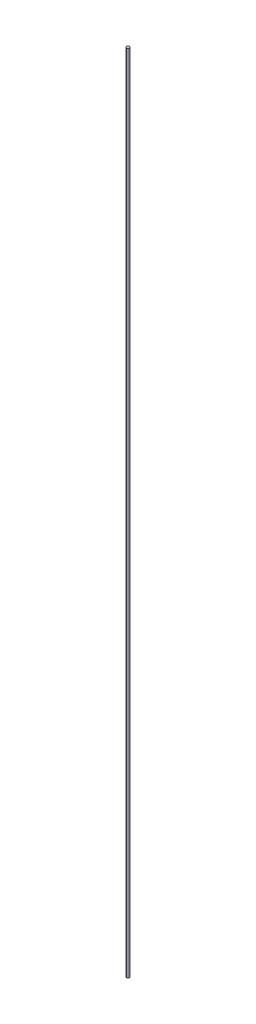
ISO-10303-21;
HEADER;
FILE_DESCRIPTION(('STEP AP214'),'2;1');
FILE_NAME('part.step','',(''),(''),'','','');
FILE_SCHEMA(('AUTOMOTIVE_DESIGN { 1 0 10303 214 1 1 1 1 }'));
ENDSEC;
DATA;
#1=APPLICATION_CONTEXT('core data for automotive mechanical design processes');
#2=APPLICATION_PROTOCOL_DEFINITION('international standard','automotive_design',2000,#1);
#3=PRODUCT_CONTEXT('',#1,'mechanical');
#4=PRODUCT('Part','Part','',(#3));
#5=PRODUCT_RELATED_PRODUCT_CATEGORY('part','',(#4));
#6=PRODUCT_DEFINITION_FORMATION('','',#4);
#7=PRODUCT_DEFINITION_CONTEXT('part definition',#1,'design');
#8=PRODUCT_DEFINITION('design','',#6,#7);
#9=PRODUCT_DEFINITION_SHAPE('','',#8);
#10=(LENGTH_UNIT() NAMED_UNIT(*) SI_UNIT(.MILLI.,.METRE.));
#11=(NAMED_UNIT(*) PLANE_ANGLE_UNIT() SI_UNIT($,.RADIAN.));
#12=(NAMED_UNIT(*) SI_UNIT($,.STERADIAN.) SOLID_ANGLE_UNIT());
#13=UNCERTAINTY_MEASURE_WITH_UNIT(LENGTH_MEASURE(1.E-05),#10,'distance_accuracy_value','');
#14=(GEOMETRIC_REPRESENTATION_CONTEXT(3) GLOBAL_UNCERTAINTY_ASSIGNED_CONTEXT((#13)) GLOBAL_UNIT_ASSIGNED_CONTEXT((#10,
#11,#12)) REPRESENTATION_CONTEXT('',''));
#15=CARTESIAN_POINT('',(0.,0.,0.));
#16=DIRECTION('',(0.,0.,1.));
#17=DIRECTION('',(1.,0.,0.));
#18=AXIS2_PLACEMENT_3D('',#15,#16,#17);
#19=CARTESIAN_POINT('',(0.,0.,0.));
#20=DIRECTION('',(0.,1.,0.));
#21=DIRECTION('',(1.,0.,0.));
#22=AXIS2_PLACEMENT_3D('',#19,#20,#21);
#23=PLANE('',#22);
#24=CARTESIAN_POINT('',(0.,0.,0.));
#25=DIRECTION('',(0.,1.,0.));
#26=DIRECTION('',(0.,0.,1.));
#27=AXIS2_PLACEMENT_3D('',#24,#25,#26);
#28=CIRCLE('',#27,0.508);
#29=CARTESIAN_POINT('',(0.,0.,-0.508));
#30=VERTEX_POINT('',#29);
#31=CARTESIAN_POINT('',(0.,0.,0.508));
#32=VERTEX_POINT('',#31);
#33=EDGE_CURVE('E9',#30,#32,#28,.T.);
#34=ORIENTED_EDGE('',*,*,#33,.F.);
#35=CARTESIAN_POINT('',(0.,0.,0.));
#36=DIRECTION('',(0.,1.,0.));
#37=DIRECTION('',(0.,0.,1.));
#38=AXIS2_PLACEMENT_3D('',#35,#36,#37);
#39=CIRCLE('',#38,0.508);
#40=EDGE_CURVE('E60',#32,#30,#39,.T.);
#41=ORIENTED_EDGE('',*,*,#40,.F.);
#42=EDGE_LOOP('',(#34,#41));
#43=FACE_BOUND('',#42,.T.);
#44=ADVANCED_FACE('F14',(#43),#23,.F.);
#45=CARTESIAN_POINT('',(0.,285.14,0.));
#46=DIRECTION('',(0.,1.,0.));
#47=DIRECTION('',(1.,0.,0.));
#48=AXIS2_PLACEMENT_3D('',#45,#46,#47);
#49=PLANE('',#48);
#50=CARTESIAN_POINT('',(0.,285.14,0.));
#51=DIRECTION('',(0.,1.,0.));
#52=DIRECTION('',(0.,0.,1.));
#53=AXIS2_PLACEMENT_3D('',#50,#51,#52);
#54=CIRCLE('',#53,0.508);
#55=CARTESIAN_POINT('',(0.,285.14,-0.508));
#56=VERTEX_POINT('',#55);
#57=CARTESIAN_POINT('',(0.,285.14,0.508));
#58=VERTEX_POINT('',#57);
#59=EDGE_CURVE('E17',#56,#58,#54,.T.);
#60=ORIENTED_EDGE('',*,*,#59,.T.);
#61=CARTESIAN_POINT('',(0.,285.14,0.));
#62=DIRECTION('',(0.,1.,0.));
#63=DIRECTION('',(0.,0.,1.));
#64=AXIS2_PLACEMENT_3D('',#61,#62,#63);
#65=CIRCLE('',#64,0.508);
#66=EDGE_CURVE('E59',#58,#56,#65,.T.);
#67=ORIENTED_EDGE('',*,*,#66,.T.);
#68=EDGE_LOOP('',(#60,#67));
#69=FACE_BOUND('',#68,.T.);
#70=ADVANCED_FACE('F62',(#69),#49,.T.);
#71=CARTESIAN_POINT('',(0.,285.14,0.));
#72=DIRECTION('',(0.,-1.,0.));
#73=DIRECTION('',(0.,0.,-1.));
#74=AXIS2_PLACEMENT_3D('',#71,#72,#73);
#75=CYLINDRICAL_SURFACE('',#74,0.508);
#76=DIRECTION('',(0.,-1.,0.));
#77=VECTOR('',#76,1.);
#78=CARTESIAN_POINT('',(0.,285.14,0.508));
#79=LINE('',#78,#77);
#80=EDGE_CURVE('E52',#58,#32,#79,.T.);
#81=ORIENTED_EDGE('',*,*,#80,.F.);
#82=ORIENTED_EDGE('',*,*,#59,.F.);
#83=DIRECTION('',(0.,-1.,0.));
#84=VECTOR('',#83,1.);
#85=CARTESIAN_POINT('',(0.,285.14,-0.508));
#86=LINE('',#85,#84);
#87=EDGE_CURVE('E49',#56,#30,#86,.T.);
#88=ORIENTED_EDGE('',*,*,#87,.T.);
#89=ORIENTED_EDGE('',*,*,#33,.T.);
#90=EDGE_LOOP('',(#81,#82,#88,#89));
#91=FACE_BOUND('',#90,.T.);
#92=ADVANCED_FACE('F48',(#91),#75,.T.);
#93=CARTESIAN_POINT('',(0.,285.14,0.));
#94=DIRECTION('',(0.,-1.,0.));
#95=DIRECTION('',(0.,0.,-1.));
#96=AXIS2_PLACEMENT_3D('',#93,#94,#95);
#97=CYLINDRICAL_SURFACE('',#96,0.508);
#98=ORIENTED_EDGE('',*,*,#66,.F.);
#99=ORIENTED_EDGE('',*,*,#80,.T.);
#100=ORIENTED_EDGE('',*,*,#40,.T.);
#101=ORIENTED_EDGE('',*,*,#87,.F.);
#102=EDGE_LOOP('',(#98,#99,#100,#101));
#103=FACE_BOUND('',#102,.T.);
#104=ADVANCED_FACE('F58',(#103),#97,.T.);
#105=CLOSED_SHELL('',(#44,#70,#92,#104));
#106=MANIFOLD_SOLID_BREP('B1',#105);
#107=ADVANCED_BREP_SHAPE_REPRESENTATION('',(#18,#106),#14);
#108=SHAPE_DEFINITION_REPRESENTATION(#9,#107);
ENDSEC;
END-ISO-10303-21;
